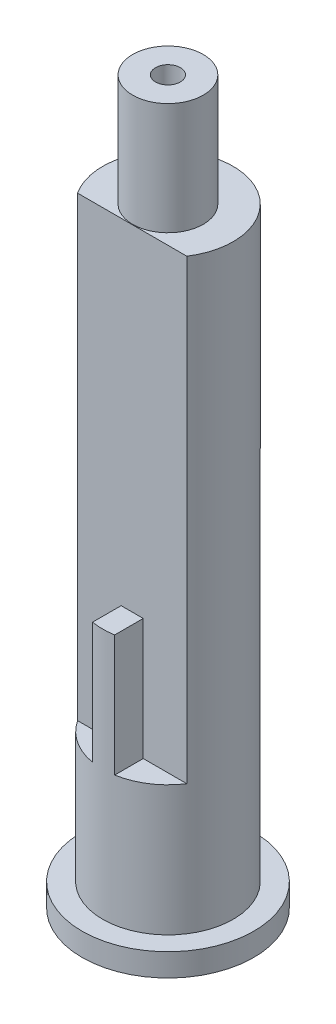
ISO-10303-21;
HEADER;
FILE_DESCRIPTION(('STEP AP214'),'2;1');
FILE_NAME('part.step','',(''),(''),'','','');
FILE_SCHEMA(('AUTOMOTIVE_DESIGN { 1 0 10303 214 1 1 1 1 }'));
ENDSEC;
DATA;
#1=APPLICATION_CONTEXT('core data for automotive mechanical design processes');
#2=APPLICATION_PROTOCOL_DEFINITION('international standard','automotive_design',2000,#1);
#3=PRODUCT_CONTEXT('',#1,'mechanical');
#4=PRODUCT('Part','Part','',(#3));
#5=PRODUCT_RELATED_PRODUCT_CATEGORY('part','',(#4));
#6=PRODUCT_DEFINITION_FORMATION('','',#4);
#7=PRODUCT_DEFINITION_CONTEXT('part definition',#1,'design');
#8=PRODUCT_DEFINITION('design','',#6,#7);
#9=PRODUCT_DEFINITION_SHAPE('','',#8);
#10=(LENGTH_UNIT() NAMED_UNIT(*) SI_UNIT(.MILLI.,.METRE.));
#11=(NAMED_UNIT(*) PLANE_ANGLE_UNIT() SI_UNIT($,.RADIAN.));
#12=(NAMED_UNIT(*) SI_UNIT($,.STERADIAN.) SOLID_ANGLE_UNIT());
#13=UNCERTAINTY_MEASURE_WITH_UNIT(LENGTH_MEASURE(1.E-05),#10,'distance_accuracy_value','');
#14=(GEOMETRIC_REPRESENTATION_CONTEXT(3) GLOBAL_UNCERTAINTY_ASSIGNED_CONTEXT((#13)) GLOBAL_UNIT_ASSIGNED_CONTEXT((#10,
#11,#12)) REPRESENTATION_CONTEXT('',''));
#15=CARTESIAN_POINT('',(0.,0.,0.));
#16=DIRECTION('',(0.,0.,1.));
#17=DIRECTION('',(1.,0.,0.));
#18=AXIS2_PLACEMENT_3D('',#15,#16,#17);
#19=CARTESIAN_POINT('',(0.,8.82,0.));
#20=DIRECTION('',(0.,1.,0.));
#21=DIRECTION('',(0.,0.,1.));
#22=AXIS2_PLACEMENT_3D('',#19,#20,#21);
#23=PLANE('',#22);
#24=DIRECTION('',(-1.,0.,0.));
#25=VECTOR('',#24,1.);
#26=CARTESIAN_POINT('',(0.,8.82,0.959999999999999));
#27=LINE('',#26,#25);
#28=CARTESIAN_POINT('',(3.33456144042961,8.82,0.959999999999999));
#29=VERTEX_POINT('',#28);
#30=CARTESIAN_POINT('',(-3.33456144042961,8.82000000000001,0.959999999999999));
#31=VERTEX_POINT('',#30);
#32=EDGE_CURVE('E11',#29,#31,#27,.T.);
#33=ORIENTED_EDGE('',*,*,#32,.F.);
#34=CARTESIAN_POINT('',(0.,8.82,0.));
#35=DIRECTION('',(0.,1.,0.));
#36=DIRECTION('',(0.,0.,1.));
#37=AXIS2_PLACEMENT_3D('',#34,#35,#36);
#38=CIRCLE('',#37,3.47);
#39=EDGE_CURVE('E125',#31,#29,#38,.T.);
#40=ORIENTED_EDGE('',*,*,#39,.F.);
#41=EDGE_LOOP('',(#33,#40));
#42=FACE_BOUND('',#41,.T.);
#43=ADVANCED_FACE('F38',(#42),#23,.F.);
#44=CARTESIAN_POINT('',(0.,44.41,0.));
#45=DIRECTION('',(0.,-1.,0.));
#46=DIRECTION('',(0.,0.,-1.));
#47=AXIS2_PLACEMENT_3D('',#44,#45,#46);
#48=CYLINDRICAL_SURFACE('',#47,4.755);
#49=CARTESIAN_POINT('',(0.,1.66,0.));
#50=DIRECTION('',(0.,1.,0.));
#51=DIRECTION('',(0.,0.,1.));
#52=AXIS2_PLACEMENT_3D('',#49,#50,#51);
#53=CIRCLE('',#52,4.755);
#54=CARTESIAN_POINT('',(0.,1.66,4.755));
#55=VERTEX_POINT('',#54);
#56=EDGE_CURVE('E180',#55,#55,#53,.F.);
#57=ORIENTED_EDGE('',*,*,#56,.F.);
#58=EDGE_LOOP('',(#57));
#59=FACE_BOUND('',#58,.T.);
#60=CARTESIAN_POINT('',(0.,19.97,0.));
#61=DIRECTION('',(0.,1.,0.));
#62=DIRECTION('',(0.,0.,1.));
#63=AXIS2_PLACEMENT_3D('',#60,#61,#62);
#64=CIRCLE('',#63,4.755);
#65=CARTESIAN_POINT('',(-0.805,19.97,4.68636319548539));
#66=VERTEX_POINT('',#65);
#67=CARTESIAN_POINT('',(0.805000000000001,19.97,4.68636319548539));
#68=VERTEX_POINT('',#67);
#69=EDGE_CURVE('E133',#66,#68,#64,.T.);
#70=ORIENTED_EDGE('',*,*,#69,.F.);
#71=DIRECTION('',(0.,1.,0.));
#72=VECTOR('',#71,1.);
#73=CARTESIAN_POINT('',(-0.805,11.13,4.68636319548539));
#74=LINE('',#73,#72);
#75=CARTESIAN_POINT('',(-0.805,11.13,4.68636319548539));
#76=VERTEX_POINT('',#75);
#77=EDGE_CURVE('E166',#76,#66,#74,.T.);
#78=ORIENTED_EDGE('',*,*,#77,.F.);
#79=CARTESIAN_POINT('',(0.,11.13,0.));
#80=DIRECTION('',(0.,1.,0.));
#81=DIRECTION('',(0.,0.,1.));
#82=AXIS2_PLACEMENT_3D('',#79,#80,#81);
#83=CIRCLE('',#82,4.755);
#84=CARTESIAN_POINT('',(-3.97793916494458,11.13,2.605));
#85=VERTEX_POINT('',#84);
#86=EDGE_CURVE('E136',#85,#76,#83,.T.);
#87=ORIENTED_EDGE('',*,*,#86,.F.);
#88=DIRECTION('',(0.,1.,0.));
#89=VECTOR('',#88,1.);
#90=CARTESIAN_POINT('',(-3.97793916494458,11.13,2.605));
#91=LINE('',#90,#89);
#92=CARTESIAN_POINT('',(-3.97793916494458,44.41,2.605));
#93=VERTEX_POINT('',#92);
#94=EDGE_CURVE('E149',#85,#93,#91,.T.);
#95=ORIENTED_EDGE('',*,*,#94,.T.);
#96=CARTESIAN_POINT('',(0.,44.41,0.));
#97=DIRECTION('',(0.,1.,0.));
#98=DIRECTION('',(0.,0.,1.));
#99=AXIS2_PLACEMENT_3D('',#96,#97,#98);
#100=CIRCLE('',#99,4.755);
#101=CARTESIAN_POINT('',(3.97793916494458,44.41,2.605));
#102=VERTEX_POINT('',#101);
#103=EDGE_CURVE('E177',#102,#93,#100,.T.);
#104=ORIENTED_EDGE('',*,*,#103,.F.);
#105=DIRECTION('',(0.,1.,0.));
#106=VECTOR('',#105,1.);
#107=CARTESIAN_POINT('',(3.97793916494458,11.13,2.605));
#108=LINE('',#107,#106);
#109=CARTESIAN_POINT('',(3.97793916494458,11.13,2.605));
#110=VERTEX_POINT('',#109);
#111=EDGE_CURVE('E147',#110,#102,#108,.T.);
#112=ORIENTED_EDGE('',*,*,#111,.F.);
#113=CARTESIAN_POINT('',(0.,11.13,0.));
#114=DIRECTION('',(0.,1.,0.));
#115=DIRECTION('',(0.,0.,1.));
#116=AXIS2_PLACEMENT_3D('',#113,#114,#115);
#117=CIRCLE('',#116,4.755);
#118=CARTESIAN_POINT('',(0.805,11.13,4.68636319548539));
#119=VERTEX_POINT('',#118);
#120=EDGE_CURVE('E137',#119,#110,#117,.T.);
#121=ORIENTED_EDGE('',*,*,#120,.F.);
#122=DIRECTION('',(0.,1.,0.));
#123=VECTOR('',#122,1.);
#124=CARTESIAN_POINT('',(0.805,11.13,4.68636319548539));
#125=LINE('',#124,#123);
#126=EDGE_CURVE('E150',#119,#68,#125,.T.);
#127=ORIENTED_EDGE('',*,*,#126,.T.);
#128=EDGE_LOOP('',(#70,#78,#87,#95,#104,#112,#121,#127));
#129=FACE_BOUND('',#128,.T.);
#130=ADVANCED_FACE('F213',(#59,#129),#48,.T.);
#131=CARTESIAN_POINT('',(-0.805,11.13,2.605));
#132=DIRECTION('',(1.,0.,0.));
#133=DIRECTION('',(0.,0.,-1.));
#134=AXIS2_PLACEMENT_3D('',#131,#132,#133);
#135=PLANE('',#134);
#136=DIRECTION('',(0.,0.,1.));
#137=VECTOR('',#136,1.);
#138=CARTESIAN_POINT('',(-0.805,19.97,2.605));
#139=LINE('',#138,#137);
#140=CARTESIAN_POINT('',(-0.805,19.97,2.605));
#141=VERTEX_POINT('',#140);
#142=EDGE_CURVE('E131',#141,#66,#139,.T.);
#143=ORIENTED_EDGE('',*,*,#142,.F.);
#144=DIRECTION('',(0.,1.,0.));
#145=VECTOR('',#144,1.);
#146=CARTESIAN_POINT('',(-0.805,11.13,2.605));
#147=LINE('',#146,#145);
#148=CARTESIAN_POINT('',(-0.805,11.13,2.605));
#149=VERTEX_POINT('',#148);
#150=EDGE_CURVE('E169',#149,#141,#147,.T.);
#151=ORIENTED_EDGE('',*,*,#150,.F.);
#152=DIRECTION('',(0.,0.,-1.));
#153=VECTOR('',#152,1.);
#154=CARTESIAN_POINT('',(-0.805,11.13,2.605));
#155=LINE('',#154,#153);
#156=EDGE_CURVE('E160',#76,#149,#155,.T.);
#157=ORIENTED_EDGE('',*,*,#156,.F.);
#158=ORIENTED_EDGE('',*,*,#77,.T.);
#159=EDGE_LOOP('',(#143,#151,#157,#158));
#160=FACE_BOUND('',#159,.T.);
#161=ADVANCED_FACE('F219',(#160),#135,.F.);
#162=CARTESIAN_POINT('',(0.805,11.13,2.605));
#163=DIRECTION('',(-1.,0.,0.));
#164=DIRECTION('',(0.,0.,1.));
#165=AXIS2_PLACEMENT_3D('',#162,#163,#164);
#166=PLANE('',#165);
#167=DIRECTION('',(0.,0.,-1.));
#168=VECTOR('',#167,1.);
#169=CARTESIAN_POINT('',(0.805,19.97,2.605));
#170=LINE('',#169,#168);
#171=CARTESIAN_POINT('',(0.805,19.97,2.605));
#172=VERTEX_POINT('',#171);
#173=EDGE_CURVE('E60',#68,#172,#170,.T.);
#174=ORIENTED_EDGE('',*,*,#173,.F.);
#175=ORIENTED_EDGE('',*,*,#126,.F.);
#176=DIRECTION('',(0.,0.,1.));
#177=VECTOR('',#176,1.);
#178=CARTESIAN_POINT('',(0.805,11.13,2.605));
#179=LINE('',#178,#177);
#180=CARTESIAN_POINT('',(0.805,11.13,2.605));
#181=VERTEX_POINT('',#180);
#182=EDGE_CURVE('E144',#181,#119,#179,.T.);
#183=ORIENTED_EDGE('',*,*,#182,.F.);
#184=DIRECTION('',(0.,1.,0.));
#185=VECTOR('',#184,1.);
#186=CARTESIAN_POINT('',(0.805,11.13,2.605));
#187=LINE('',#186,#185);
#188=EDGE_CURVE('E154',#181,#172,#187,.T.);
#189=ORIENTED_EDGE('',*,*,#188,.T.);
#190=EDGE_LOOP('',(#174,#175,#183,#189));
#191=FACE_BOUND('',#190,.T.);
#192=ADVANCED_FACE('F236',(#191),#166,.F.);
#193=CARTESIAN_POINT('',(0.,1.66,0.));
#194=DIRECTION('',(0.,-1.,0.));
#195=DIRECTION('',(0.,0.,-1.));
#196=AXIS2_PLACEMENT_3D('',#193,#194,#195);
#197=CYLINDRICAL_SURFACE('',#196,6.255);
#198=CARTESIAN_POINT('',(0.,1.66,0.));
#199=DIRECTION('',(0.,1.,0.));
#200=DIRECTION('',(0.,0.,1.));
#201=AXIS2_PLACEMENT_3D('',#198,#199,#200);
#202=CIRCLE('',#201,6.255);
#203=CARTESIAN_POINT('',(0.,1.66,6.255));
#204=VERTEX_POINT('',#203);
#205=EDGE_CURVE('E46',#204,#204,#202,.T.);
#206=ORIENTED_EDGE('',*,*,#205,.F.);
#207=EDGE_LOOP('',(#206));
#208=FACE_BOUND('',#207,.T.);
#209=CARTESIAN_POINT('',(0.,0.,0.));
#210=DIRECTION('',(0.,1.,0.));
#211=DIRECTION('',(0.,0.,1.));
#212=AXIS2_PLACEMENT_3D('',#209,#210,#211);
#213=CIRCLE('',#212,6.255);
#214=CARTESIAN_POINT('',(0.,0.,6.255));
#215=VERTEX_POINT('',#214);
#216=EDGE_CURVE('E183',#215,#215,#213,.T.);
#217=ORIENTED_EDGE('',*,*,#216,.T.);
#218=EDGE_LOOP('',(#217));
#219=FACE_BOUND('',#218,.T.);
#220=ADVANCED_FACE('F40',(#208,#219),#197,.T.);
#221=CARTESIAN_POINT('',(0.,1.66,0.));
#222=DIRECTION('',(0.,1.,0.));
#223=DIRECTION('',(0.,0.,1.));
#224=AXIS2_PLACEMENT_3D('',#221,#222,#223);
#225=PLANE('',#224);
#226=ORIENTED_EDGE('',*,*,#56,.T.);
#227=EDGE_LOOP('',(#226));
#228=FACE_BOUND('',#227,.T.);
#229=ORIENTED_EDGE('',*,*,#205,.T.);
#230=EDGE_LOOP('',(#229));
#231=FACE_BOUND('',#230,.T.);
#232=ADVANCED_FACE('F264',(#228,#231),#225,.T.);
#233=CARTESIAN_POINT('',(0.,0.,0.));
#234=DIRECTION('',(0.,1.,0.));
#235=DIRECTION('',(0.,0.,1.));
#236=AXIS2_PLACEMENT_3D('',#233,#234,#235);
#237=PLANE('',#236);
#238=CARTESIAN_POINT('',(0.,0.,0.));
#239=DIRECTION('',(0.,1.,0.));
#240=DIRECTION('',(0.,0.,1.));
#241=AXIS2_PLACEMENT_3D('',#238,#239,#240);
#242=CIRCLE('',#241,3.47);
#243=CARTESIAN_POINT('',(0.,0.,3.47));
#244=VERTEX_POINT('',#243);
#245=EDGE_CURVE('E124',#244,#244,#242,.T.);
#246=ORIENTED_EDGE('',*,*,#245,.T.);
#247=EDGE_LOOP('',(#246));
#248=FACE_BOUND('',#247,.T.);
#249=ORIENTED_EDGE('',*,*,#216,.F.);
#250=EDGE_LOOP('',(#249));
#251=FACE_BOUND('',#250,.T.);
#252=ADVANCED_FACE('F259',(#248,#251),#237,.F.);
#253=CARTESIAN_POINT('',(0.,44.41,0.));
#254=DIRECTION('',(0.,1.,0.));
#255=DIRECTION('',(0.,0.,1.));
#256=AXIS2_PLACEMENT_3D('',#253,#254,#255);
#257=PLANE('',#256);
#258=ORIENTED_EDGE('',*,*,#103,.T.);
#259=DIRECTION('',(-1.,0.,0.));
#260=VECTOR('',#259,1.);
#261=CARTESIAN_POINT('',(0.805,44.41,2.605));
#262=LINE('',#261,#260);
#263=EDGE_CURVE('E141',#102,#93,#262,.T.);
#264=ORIENTED_EDGE('',*,*,#263,.F.);
#265=EDGE_LOOP('',(#258,#264));
#266=FACE_BOUND('',#265,.T.);
#267=CARTESIAN_POINT('',(0.,44.41,0.));
#268=DIRECTION('',(0.,1.,0.));
#269=DIRECTION('',(0.,0.,1.));
#270=AXIS2_PLACEMENT_3D('',#267,#268,#269);
#271=CIRCLE('',#270,2.57);
#272=CARTESIAN_POINT('',(0.,44.41,2.57));
#273=VERTEX_POINT('',#272);
#274=EDGE_CURVE('E176',#273,#273,#271,.F.);
#275=ORIENTED_EDGE('',*,*,#274,.T.);
#276=EDGE_LOOP('',(#275));
#277=FACE_BOUND('',#276,.T.);
#278=ADVANCED_FACE('F191',(#266,#277),#257,.T.);
#279=CARTESIAN_POINT('',(0.,52.56,0.));
#280=DIRECTION('',(0.,-1.,0.));
#281=DIRECTION('',(0.,0.,-1.));
#282=AXIS2_PLACEMENT_3D('',#279,#280,#281);
#283=CYLINDRICAL_SURFACE('',#282,2.57);
#284=ORIENTED_EDGE('',*,*,#274,.F.);
#285=EDGE_LOOP('',(#284));
#286=FACE_BOUND('',#285,.T.);
#287=CARTESIAN_POINT('',(0.,52.56,0.));
#288=DIRECTION('',(0.,1.,0.));
#289=DIRECTION('',(0.,0.,1.));
#290=AXIS2_PLACEMENT_3D('',#287,#288,#289);
#291=CIRCLE('',#290,2.57);
#292=CARTESIAN_POINT('',(0.,52.56,2.57));
#293=VERTEX_POINT('',#292);
#294=EDGE_CURVE('E153',#293,#293,#291,.T.);
#295=ORIENTED_EDGE('',*,*,#294,.F.);
#296=EDGE_LOOP('',(#295));
#297=FACE_BOUND('',#296,.T.);
#298=ADVANCED_FACE('F193',(#286,#297),#283,.T.);
#299=CARTESIAN_POINT('',(0.,52.56,0.));
#300=DIRECTION('',(0.,1.,0.));
#301=DIRECTION('',(0.,0.,1.));
#302=AXIS2_PLACEMENT_3D('',#299,#300,#301);
#303=PLANE('',#302);
#304=CARTESIAN_POINT('',(0.,52.56,0.));
#305=DIRECTION('',(0.,1.,0.));
#306=DIRECTION('',(0.,0.,1.));
#307=AXIS2_PLACEMENT_3D('',#304,#305,#306);
#308=CIRCLE('',#307,0.905);
#309=CARTESIAN_POINT('',(0.,52.56,0.905));
#310=VERTEX_POINT('',#309);
#311=EDGE_CURVE('E119',#310,#310,#308,.T.);
#312=ORIENTED_EDGE('',*,*,#311,.F.);
#313=EDGE_LOOP('',(#312));
#314=FACE_BOUND('',#313,.T.);
#315=ORIENTED_EDGE('',*,*,#294,.T.);
#316=EDGE_LOOP('',(#315));
#317=FACE_BOUND('',#316,.T.);
#318=ADVANCED_FACE('F196',(#314,#317),#303,.T.);
#319=CARTESIAN_POINT('',(0.,11.13,0.));
#320=DIRECTION('',(0.,1.,0.));
#321=DIRECTION('',(0.,0.,1.));
#322=AXIS2_PLACEMENT_3D('',#319,#320,#321);
#323=PLANE('',#322);
#324=ORIENTED_EDGE('',*,*,#86,.T.);
#325=ORIENTED_EDGE('',*,*,#156,.T.);
#326=DIRECTION('',(-1.,0.,0.));
#327=VECTOR('',#326,1.);
#328=CARTESIAN_POINT('',(-3.97793916494458,11.13,2.605));
#329=LINE('',#328,#327);
#330=EDGE_CURVE('E163',#149,#85,#329,.T.);
#331=ORIENTED_EDGE('',*,*,#330,.T.);
#332=EDGE_LOOP('',(#324,#325,#331));
#333=FACE_BOUND('',#332,.T.);
#334=ADVANCED_FACE('F201',(#333),#323,.T.);
#335=CARTESIAN_POINT('',(0.805,11.13,2.605));
#336=DIRECTION('',(0.,0.,-1.));
#337=DIRECTION('',(-1.,0.,0.));
#338=AXIS2_PLACEMENT_3D('',#335,#336,#337);
#339=PLANE('',#338);
#340=ORIENTED_EDGE('',*,*,#263,.T.);
#341=ORIENTED_EDGE('',*,*,#94,.F.);
#342=ORIENTED_EDGE('',*,*,#330,.F.);
#343=ORIENTED_EDGE('',*,*,#150,.T.);
#344=DIRECTION('',(-1.,0.,0.));
#345=VECTOR('',#344,1.);
#346=CARTESIAN_POINT('',(-0.805,19.97,2.605));
#347=LINE('',#346,#345);
#348=EDGE_CURVE('E127',#172,#141,#347,.T.);
#349=ORIENTED_EDGE('',*,*,#348,.F.);
#350=ORIENTED_EDGE('',*,*,#188,.F.);
#351=DIRECTION('',(-1.,0.,0.));
#352=VECTOR('',#351,1.);
#353=CARTESIAN_POINT('',(0.805,11.13,2.605));
#354=LINE('',#353,#352);
#355=EDGE_CURVE('E140',#110,#181,#354,.T.);
#356=ORIENTED_EDGE('',*,*,#355,.F.);
#357=ORIENTED_EDGE('',*,*,#111,.T.);
#358=EDGE_LOOP('',(#340,#341,#342,#343,#349,#350,#356,#357));
#359=FACE_BOUND('',#358,.T.);
#360=ADVANCED_FACE('F207',(#359),#339,.F.);
#361=CARTESIAN_POINT('',(0.,11.13,0.));
#362=DIRECTION('',(0.,1.,0.));
#363=DIRECTION('',(0.,0.,1.));
#364=AXIS2_PLACEMENT_3D('',#361,#362,#363);
#365=PLANE('',#364);
#366=ORIENTED_EDGE('',*,*,#120,.T.);
#367=ORIENTED_EDGE('',*,*,#355,.T.);
#368=ORIENTED_EDGE('',*,*,#182,.T.);
#369=EDGE_LOOP('',(#366,#367,#368));
#370=FACE_BOUND('',#369,.T.);
#371=ADVANCED_FACE('F232',(#370),#365,.T.);
#372=CARTESIAN_POINT('',(0.,19.97,0.));
#373=DIRECTION('',(0.,1.,0.));
#374=DIRECTION('',(0.,0.,1.));
#375=AXIS2_PLACEMENT_3D('',#372,#373,#374);
#376=PLANE('',#375);
#377=ORIENTED_EDGE('',*,*,#348,.T.);
#378=ORIENTED_EDGE('',*,*,#142,.T.);
#379=ORIENTED_EDGE('',*,*,#69,.T.);
#380=ORIENTED_EDGE('',*,*,#173,.T.);
#381=EDGE_LOOP('',(#377,#378,#379,#380));
#382=FACE_BOUND('',#381,.T.);
#383=ADVANCED_FACE('F228',(#382),#376,.T.);
#384=CARTESIAN_POINT('',(0.,8.82,0.));
#385=DIRECTION('',(0.,-1.,0.));
#386=DIRECTION('',(0.,0.,-1.));
#387=AXIS2_PLACEMENT_3D('',#384,#385,#386);
#388=CYLINDRICAL_SURFACE('',#387,3.47);
#389=ORIENTED_EDGE('',*,*,#245,.F.);
#390=EDGE_LOOP('',(#389));
#391=FACE_BOUND('',#390,.T.);
#392=ORIENTED_EDGE('',*,*,#39,.T.);
#393=DIRECTION('',(0.,-1.,0.));
#394=VECTOR('',#393,1.);
#395=CARTESIAN_POINT('',(3.33456144042961,43.23,0.959999999999999));
#396=LINE('',#395,#394);
#397=CARTESIAN_POINT('',(3.33456144042961,43.23,0.959999999999999));
#398=VERTEX_POINT('',#397);
#399=EDGE_CURVE('E52',#398,#29,#396,.T.);
#400=ORIENTED_EDGE('',*,*,#399,.F.);
#401=CARTESIAN_POINT('',(0.,43.23,0.));
#402=DIRECTION('',(0.,1.,0.));
#403=DIRECTION('',(0.,0.,1.));
#404=AXIS2_PLACEMENT_3D('',#401,#402,#403);
#405=CIRCLE('',#404,3.47);
#406=CARTESIAN_POINT('',(-3.33456144042961,43.23,0.959999999999999));
#407=VERTEX_POINT('',#406);
#408=EDGE_CURVE('E105',#398,#407,#405,.T.);
#409=ORIENTED_EDGE('',*,*,#408,.T.);
#410=DIRECTION('',(0.,-1.,0.));
#411=VECTOR('',#410,1.);
#412=CARTESIAN_POINT('',(-3.33456144042961,43.23,0.959999999999999));
#413=LINE('',#412,#411);
#414=EDGE_CURVE('E112',#407,#31,#413,.T.);
#415=ORIENTED_EDGE('',*,*,#414,.T.);
#416=EDGE_LOOP('',(#392,#400,#409,#415));
#417=FACE_BOUND('',#416,.T.);
#418=ADVANCED_FACE('F111',(#391,#417),#388,.F.);
#419=CARTESIAN_POINT('',(0.,0.,0.));
#420=DIRECTION('',(0.,1.,0.));
#421=DIRECTION('',(0.,0.,1.));
#422=AXIS2_PLACEMENT_3D('',#419,#420,#421);
#423=CYLINDRICAL_SURFACE('',#422,0.905);
#424=CARTESIAN_POINT('',(0.,43.23,0.));
#425=DIRECTION('',(0.,1.,0.));
#426=DIRECTION('',(0.,0.,1.));
#427=AXIS2_PLACEMENT_3D('',#424,#425,#426);
#428=CIRCLE('',#427,0.905);
#429=CARTESIAN_POINT('',(0.,43.23,0.905));
#430=VERTEX_POINT('',#429);
#431=EDGE_CURVE('E116',#430,#430,#428,.F.);
#432=ORIENTED_EDGE('',*,*,#431,.T.);
#433=EDGE_LOOP('',(#432));
#434=FACE_BOUND('',#433,.T.);
#435=ORIENTED_EDGE('',*,*,#311,.T.);
#436=EDGE_LOOP('',(#435));
#437=FACE_BOUND('',#436,.T.);
#438=ADVANCED_FACE('F224',(#434,#437),#423,.F.);
#439=CARTESIAN_POINT('',(-3.33456144042961,43.23,0.959999999999999));
#440=DIRECTION('',(0.,0.,-1.));
#441=DIRECTION('',(-1.,0.,0.));
#442=AXIS2_PLACEMENT_3D('',#439,#440,#441);
#443=PLANE('',#442);
#444=ORIENTED_EDGE('',*,*,#32,.T.);
#445=ORIENTED_EDGE('',*,*,#414,.F.);
#446=DIRECTION('',(1.,0.,0.));
#447=VECTOR('',#446,1.);
#448=CARTESIAN_POINT('',(-3.33456144042961,43.23,0.959999999999999));
#449=LINE('',#448,#447);
#450=EDGE_CURVE('E101',#407,#398,#449,.T.);
#451=ORIENTED_EDGE('',*,*,#450,.T.);
#452=ORIENTED_EDGE('',*,*,#399,.T.);
#453=EDGE_LOOP('',(#444,#445,#451,#452));
#454=FACE_BOUND('',#453,.T.);
#455=ADVANCED_FACE('F115',(#454),#443,.T.);
#456=CARTESIAN_POINT('',(0.,43.23,0.));
#457=DIRECTION('',(0.,1.,0.));
#458=DIRECTION('',(0.,0.,1.));
#459=AXIS2_PLACEMENT_3D('',#456,#457,#458);
#460=PLANE('',#459);
#461=ORIENTED_EDGE('',*,*,#408,.F.);
#462=ORIENTED_EDGE('',*,*,#450,.F.);
#463=EDGE_LOOP('',(#461,#462));
#464=FACE_BOUND('',#463,.T.);
#465=ORIENTED_EDGE('',*,*,#431,.F.);
#466=EDGE_LOOP('',(#465));
#467=FACE_BOUND('',#466,.T.);
#468=ADVANCED_FACE('F103',(#464,#467),#460,.F.);
#469=CLOSED_SHELL('',(#43,#130,#161,#192,#220,#232,#252,#278,#298,#318,#334,#360,#371,#383,#418,
#438,#455,#468));
#470=MANIFOLD_SOLID_BREP('B2',#469);
#471=ADVANCED_BREP_SHAPE_REPRESENTATION('',(#18,#470),#14);
#472=SHAPE_DEFINITION_REPRESENTATION(#9,#471);
ENDSEC;
END-ISO-10303-21;
